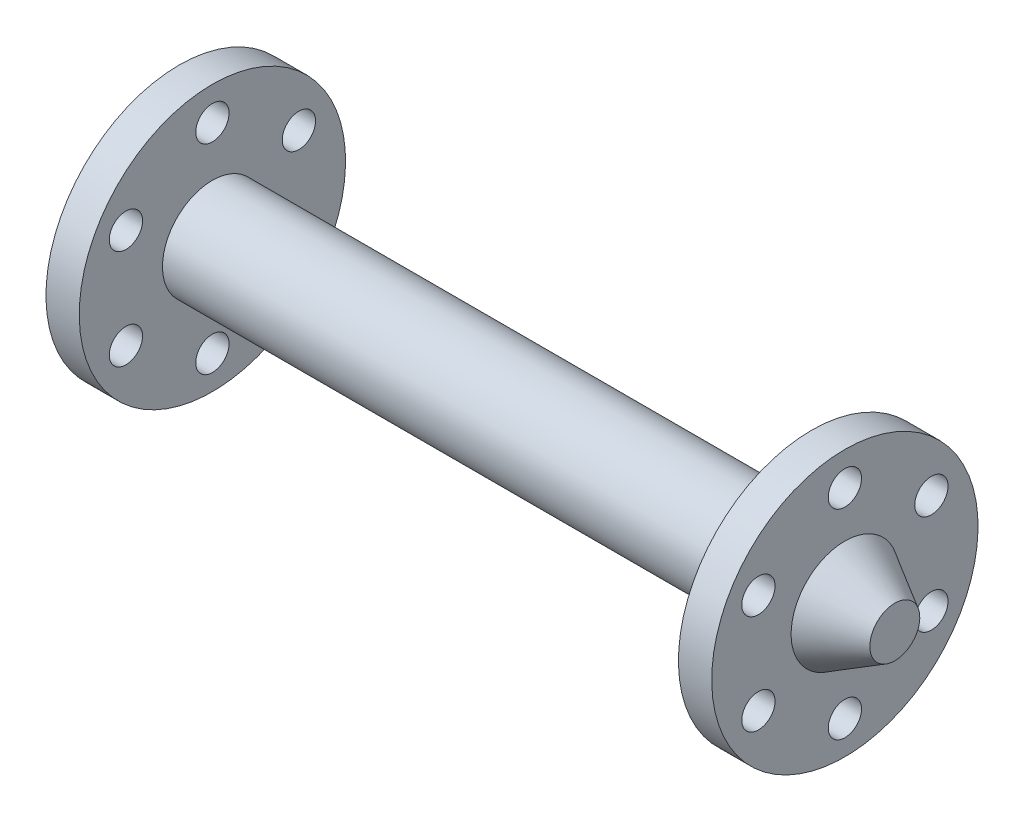
ISO-10303-21;
HEADER;
FILE_DESCRIPTION(('STEP AP214'),'2;1');
FILE_NAME('part.step','',(''),(''),'','','');
FILE_SCHEMA(('AUTOMOTIVE_DESIGN { 1 0 10303 214 1 1 1 1 }'));
ENDSEC;
DATA;
#1=APPLICATION_CONTEXT('core data for automotive mechanical design processes');
#2=APPLICATION_PROTOCOL_DEFINITION('international standard','automotive_design',2000,#1);
#3=PRODUCT_CONTEXT('',#1,'mechanical');
#4=PRODUCT('Part','Part','',(#3));
#5=PRODUCT_RELATED_PRODUCT_CATEGORY('part','',(#4));
#6=PRODUCT_DEFINITION_FORMATION('','',#4);
#7=PRODUCT_DEFINITION_CONTEXT('part definition',#1,'design');
#8=PRODUCT_DEFINITION('design','',#6,#7);
#9=PRODUCT_DEFINITION_SHAPE('','',#8);
#10=(LENGTH_UNIT() NAMED_UNIT(*) SI_UNIT(.MILLI.,.METRE.));
#11=(NAMED_UNIT(*) PLANE_ANGLE_UNIT() SI_UNIT($,.RADIAN.));
#12=(NAMED_UNIT(*) SI_UNIT($,.STERADIAN.) SOLID_ANGLE_UNIT());
#13=UNCERTAINTY_MEASURE_WITH_UNIT(LENGTH_MEASURE(1.E-05),#10,'distance_accuracy_value','');
#14=(GEOMETRIC_REPRESENTATION_CONTEXT(3) GLOBAL_UNCERTAINTY_ASSIGNED_CONTEXT((#13)) GLOBAL_UNIT_ASSIGNED_CONTEXT((#10,
#11,#12)) REPRESENTATION_CONTEXT('',''));
#15=CARTESIAN_POINT('',(0.,0.,0.));
#16=DIRECTION('',(0.,0.,1.));
#17=DIRECTION('',(1.,0.,0.));
#18=AXIS2_PLACEMENT_3D('',#15,#16,#17);
#19=CARTESIAN_POINT('',(-230.,0.,0.));
#20=DIRECTION('',(-1.,0.,0.));
#21=DIRECTION('',(0.,-1.,0.));
#22=AXIS2_PLACEMENT_3D('',#19,#20,#21);
#23=PLANE('',#22);
#24=CARTESIAN_POINT('',(-230.,0.,0.));
#25=DIRECTION('',(1.,0.,0.));
#26=DIRECTION('',(0.,1.,0.));
#27=AXIS2_PLACEMENT_3D('',#24,#25,#26);
#28=CIRCLE('',#27,15.);
#29=CARTESIAN_POINT('',(-230.,15.,0.));
#30=VERTEX_POINT('',#29);
#31=EDGE_CURVE('E10',#30,#30,#28,.T.);
#32=ORIENTED_EDGE('',*,*,#31,.F.);
#33=EDGE_LOOP('',(#32));
#34=FACE_BOUND('',#33,.T.);
#35=ADVANCED_FACE('F41',(#34),#23,.T.);
#36=CARTESIAN_POINT('',(-200.,0.,0.));
#37=DIRECTION('',(1.,0.,0.));
#38=DIRECTION('',(0.,1.,0.));
#39=AXIS2_PLACEMENT_3D('',#36,#37,#38);
#40=CONICAL_SURFACE('',#39,32.3205080756885,0.523598775598293);
#41=ORIENTED_EDGE('',*,*,#31,.T.);
#42=EDGE_LOOP('',(#41));
#43=FACE_BOUND('',#42,.T.);
#44=CARTESIAN_POINT('',(-200.,0.,0.));
#45=DIRECTION('',(1.,0.,0.));
#46=DIRECTION('',(0.,1.,0.));
#47=AXIS2_PLACEMENT_3D('',#44,#45,#46);
#48=CIRCLE('',#47,32.3205080756885);
#49=CARTESIAN_POINT('',(-200.,32.3205080756885,0.));
#50=VERTEX_POINT('',#49);
#51=EDGE_CURVE('E49',#50,#50,#48,.T.);
#52=ORIENTED_EDGE('',*,*,#51,.F.);
#53=EDGE_LOOP('',(#52));
#54=FACE_BOUND('',#53,.T.);
#55=ADVANCED_FACE('F184',(#43,#54),#40,.T.);
#56=CARTESIAN_POINT('',(-200.,32.3205080756885,0.));
#57=DIRECTION('',(-1.,0.,0.));
#58=DIRECTION('',(0.,-1.,0.));
#59=AXIS2_PLACEMENT_3D('',#56,#57,#58);
#60=PLANE('',#59);
#61=CARTESIAN_POINT('',(-200.,30.0000000000006,-51.961524227066));
#62=DIRECTION('',(-1.,0.,0.));
#63=DIRECTION('',(0.,0.,1.));
#64=AXIS2_PLACEMENT_3D('',#61,#62,#63);
#65=CIRCLE('',#64,9.99999999999995);
#66=CARTESIAN_POINT('',(-200.,30.0000000000006,-41.961524227066));
#67=VERTEX_POINT('',#66);
#68=EDGE_CURVE('E451',#67,#67,#65,.T.);
#69=ORIENTED_EDGE('',*,*,#68,.F.);
#70=EDGE_LOOP('',(#69));
#71=FACE_BOUND('',#70,.T.);
#72=CARTESIAN_POINT('',(-200.,-29.9999999999996,-51.9615242270666));
#73=DIRECTION('',(-1.,0.,0.));
#74=DIRECTION('',(0.,0.,1.));
#75=AXIS2_PLACEMENT_3D('',#72,#73,#74);
#76=CIRCLE('',#75,9.99999999999995);
#77=CARTESIAN_POINT('',(-200.,-29.9999999999996,-41.9615242270667));
#78=VERTEX_POINT('',#77);
#79=EDGE_CURVE('E62',#78,#78,#76,.T.);
#80=ORIENTED_EDGE('',*,*,#79,.F.);
#81=EDGE_LOOP('',(#80));
#82=FACE_BOUND('',#81,.T.);
#83=CARTESIAN_POINT('',(-200.,-60.0000000000001,0.));
#84=DIRECTION('',(-1.,0.,0.));
#85=DIRECTION('',(0.,0.,1.));
#86=AXIS2_PLACEMENT_3D('',#83,#84,#85);
#87=CIRCLE('',#86,9.99999999999995);
#88=CARTESIAN_POINT('',(-200.,-60.0000000000001,9.99999999999995));
#89=VERTEX_POINT('',#88);
#90=EDGE_CURVE('E84',#89,#89,#87,.T.);
#91=ORIENTED_EDGE('',*,*,#90,.F.);
#92=EDGE_LOOP('',(#91));
#93=FACE_BOUND('',#92,.T.);
#94=CARTESIAN_POINT('',(-200.,-30.0000000000003,51.9615242270662));
#95=DIRECTION('',(-1.,0.,0.));
#96=DIRECTION('',(0.,0.,1.));
#97=AXIS2_PLACEMENT_3D('',#94,#95,#96);
#98=CIRCLE('',#97,9.99999999999995);
#99=CARTESIAN_POINT('',(-200.,-30.0000000000003,61.9615242270662));
#100=VERTEX_POINT('',#99);
#101=EDGE_CURVE('E100',#100,#100,#98,.T.);
#102=ORIENTED_EDGE('',*,*,#101,.F.);
#103=EDGE_LOOP('',(#102));
#104=FACE_BOUND('',#103,.T.);
#105=CARTESIAN_POINT('',(-200.,29.9999999999999,51.9615242270664));
#106=DIRECTION('',(-1.,0.,0.));
#107=DIRECTION('',(0.,0.,1.));
#108=AXIS2_PLACEMENT_3D('',#105,#106,#107);
#109=CIRCLE('',#108,9.99999999999994);
#110=CARTESIAN_POINT('',(-200.,29.9999999999999,61.9615242270664));
#111=VERTEX_POINT('',#110);
#112=EDGE_CURVE('E116',#111,#111,#109,.T.);
#113=ORIENTED_EDGE('',*,*,#112,.F.);
#114=EDGE_LOOP('',(#113));
#115=FACE_BOUND('',#114,.T.);
#116=CARTESIAN_POINT('',(-200.,60.,0.));
#117=DIRECTION('',(-1.,0.,0.));
#118=DIRECTION('',(0.,0.,1.));
#119=AXIS2_PLACEMENT_3D('',#116,#117,#118);
#120=CIRCLE('',#119,9.99999999999995);
#121=CARTESIAN_POINT('',(-200.,60.,9.99999999999995));
#122=VERTEX_POINT('',#121);
#123=EDGE_CURVE('E132',#122,#122,#120,.T.);
#124=ORIENTED_EDGE('',*,*,#123,.F.);
#125=EDGE_LOOP('',(#124));
#126=FACE_BOUND('',#125,.T.);
#127=ORIENTED_EDGE('',*,*,#51,.T.);
#128=EDGE_LOOP('',(#127));
#129=FACE_BOUND('',#128,.T.);
#130=CARTESIAN_POINT('',(-200.,0.,0.));
#131=DIRECTION('',(1.,0.,0.));
#132=DIRECTION('',(0.,1.,0.));
#133=AXIS2_PLACEMENT_3D('',#130,#131,#132);
#134=CIRCLE('',#133,80.);
#135=CARTESIAN_POINT('',(-200.,80.,0.));
#136=VERTEX_POINT('',#135);
#137=EDGE_CURVE('E55',#136,#136,#134,.T.);
#138=ORIENTED_EDGE('',*,*,#137,.F.);
#139=EDGE_LOOP('',(#138));
#140=FACE_BOUND('',#139,.T.);
#141=ADVANCED_FACE('F182',(#71,#82,#93,#104,#115,#126,#129,#140),#60,.T.);
#142=CARTESIAN_POINT('',(230.,0.,0.));
#143=DIRECTION('',(1.,0.,0.));
#144=DIRECTION('',(0.,1.,0.));
#145=AXIS2_PLACEMENT_3D('',#142,#143,#144);
#146=CYLINDRICAL_SURFACE('',#145,80.);
#147=ORIENTED_EDGE('',*,*,#137,.T.);
#148=EDGE_LOOP('',(#147));
#149=FACE_BOUND('',#148,.T.);
#150=CARTESIAN_POINT('',(-180.,0.,0.));
#151=DIRECTION('',(1.,0.,0.));
#152=DIRECTION('',(0.,1.,0.));
#153=AXIS2_PLACEMENT_3D('',#150,#151,#152);
#154=CIRCLE('',#153,80.);
#155=CARTESIAN_POINT('',(-180.,80.,0.));
#156=VERTEX_POINT('',#155);
#157=EDGE_CURVE('E172',#156,#156,#154,.T.);
#158=ORIENTED_EDGE('',*,*,#157,.F.);
#159=EDGE_LOOP('',(#158));
#160=FACE_BOUND('',#159,.T.);
#161=ADVANCED_FACE('F179',(#149,#160),#146,.T.);
#162=CARTESIAN_POINT('',(-180.,80.,0.));
#163=DIRECTION('',(1.,0.,0.));
#164=DIRECTION('',(0.,1.,0.));
#165=AXIS2_PLACEMENT_3D('',#162,#163,#164);
#166=PLANE('',#165);
#167=CARTESIAN_POINT('',(-180.,30.0000000000006,-51.961524227066));
#168=DIRECTION('',(1.,0.,0.));
#169=DIRECTION('',(0.,1.,0.));
#170=AXIS2_PLACEMENT_3D('',#167,#168,#169);
#171=CIRCLE('',#170,9.99999999999992);
#172=CARTESIAN_POINT('',(-180.,40.0000000000005,-51.961524227066));
#173=VERTEX_POINT('',#172);
#174=EDGE_CURVE('E71',#173,#173,#171,.T.);
#175=ORIENTED_EDGE('',*,*,#174,.F.);
#176=EDGE_LOOP('',(#175));
#177=FACE_BOUND('',#176,.T.);
#178=CARTESIAN_POINT('',(-180.,-29.9999999999996,-51.9615242270666));
#179=DIRECTION('',(1.,0.,0.));
#180=DIRECTION('',(0.,1.,0.));
#181=AXIS2_PLACEMENT_3D('',#178,#179,#180);
#182=CIRCLE('',#181,9.99999999999992);
#183=CARTESIAN_POINT('',(-180.,-19.9999999999996,-51.9615242270666));
#184=VERTEX_POINT('',#183);
#185=EDGE_CURVE('E68',#184,#184,#182,.T.);
#186=ORIENTED_EDGE('',*,*,#185,.F.);
#187=EDGE_LOOP('',(#186));
#188=FACE_BOUND('',#187,.T.);
#189=CARTESIAN_POINT('',(-180.,-60.0000000000001,0.));
#190=DIRECTION('',(1.,0.,0.));
#191=DIRECTION('',(0.,1.,0.));
#192=AXIS2_PLACEMENT_3D('',#189,#190,#191);
#193=CIRCLE('',#192,9.99999999999992);
#194=CARTESIAN_POINT('',(-180.,-50.0000000000001,0.));
#195=VERTEX_POINT('',#194);
#196=EDGE_CURVE('E96',#195,#195,#193,.T.);
#197=ORIENTED_EDGE('',*,*,#196,.F.);
#198=EDGE_LOOP('',(#197));
#199=FACE_BOUND('',#198,.T.);
#200=CARTESIAN_POINT('',(-180.,-30.0000000000003,51.9615242270662));
#201=DIRECTION('',(1.,0.,0.));
#202=DIRECTION('',(0.,1.,0.));
#203=AXIS2_PLACEMENT_3D('',#200,#201,#202);
#204=CIRCLE('',#203,9.99999999999992);
#205=CARTESIAN_POINT('',(-180.,-20.0000000000004,51.9615242270662));
#206=VERTEX_POINT('',#205);
#207=EDGE_CURVE('E112',#206,#206,#204,.T.);
#208=ORIENTED_EDGE('',*,*,#207,.F.);
#209=EDGE_LOOP('',(#208));
#210=FACE_BOUND('',#209,.T.);
#211=CARTESIAN_POINT('',(-180.,29.9999999999999,51.9615242270664));
#212=DIRECTION('',(1.,0.,0.));
#213=DIRECTION('',(0.,1.,0.));
#214=AXIS2_PLACEMENT_3D('',#211,#212,#213);
#215=CIRCLE('',#214,9.99999999999992);
#216=CARTESIAN_POINT('',(-180.,39.9999999999998,51.9615242270664));
#217=VERTEX_POINT('',#216);
#218=EDGE_CURVE('E128',#217,#217,#215,.T.);
#219=ORIENTED_EDGE('',*,*,#218,.F.);
#220=EDGE_LOOP('',(#219));
#221=FACE_BOUND('',#220,.T.);
#222=CARTESIAN_POINT('',(-180.,60.,0.));
#223=DIRECTION('',(1.,0.,0.));
#224=DIRECTION('',(0.,1.,0.));
#225=AXIS2_PLACEMENT_3D('',#222,#223,#224);
#226=CIRCLE('',#225,9.99999999999992);
#227=CARTESIAN_POINT('',(-180.,69.9999999999999,0.));
#228=VERTEX_POINT('',#227);
#229=EDGE_CURVE('E136',#228,#228,#226,.T.);
#230=ORIENTED_EDGE('',*,*,#229,.F.);
#231=EDGE_LOOP('',(#230));
#232=FACE_BOUND('',#231,.T.);
#233=ORIENTED_EDGE('',*,*,#157,.T.);
#234=EDGE_LOOP('',(#233));
#235=FACE_BOUND('',#234,.T.);
#236=CARTESIAN_POINT('',(-180.,0.,0.));
#237=DIRECTION('',(1.,0.,0.));
#238=DIRECTION('',(0.,1.,0.));
#239=AXIS2_PLACEMENT_3D('',#236,#237,#238);
#240=CIRCLE('',#239,30.);
#241=CARTESIAN_POINT('',(-180.,30.,0.));
#242=VERTEX_POINT('',#241);
#243=EDGE_CURVE('E168',#242,#242,#240,.T.);
#244=ORIENTED_EDGE('',*,*,#243,.F.);
#245=EDGE_LOOP('',(#244));
#246=FACE_BOUND('',#245,.T.);
#247=ADVANCED_FACE('F191',(#177,#188,#199,#210,#221,#232,#235,#246),#166,.T.);
#248=CARTESIAN_POINT('',(230.,0.,0.));
#249=DIRECTION('',(1.,0.,0.));
#250=DIRECTION('',(0.,1.,0.));
#251=AXIS2_PLACEMENT_3D('',#248,#249,#250);
#252=CYLINDRICAL_SURFACE('',#251,30.);
#253=ORIENTED_EDGE('',*,*,#243,.T.);
#254=EDGE_LOOP('',(#253));
#255=FACE_BOUND('',#254,.T.);
#256=CARTESIAN_POINT('',(180.,0.,0.));
#257=DIRECTION('',(1.,0.,0.));
#258=DIRECTION('',(0.,1.,0.));
#259=AXIS2_PLACEMENT_3D('',#256,#257,#258);
#260=CIRCLE('',#259,30.);
#261=CARTESIAN_POINT('',(180.,30.,0.));
#262=VERTEX_POINT('',#261);
#263=EDGE_CURVE('E164',#262,#262,#260,.T.);
#264=ORIENTED_EDGE('',*,*,#263,.F.);
#265=EDGE_LOOP('',(#264));
#266=FACE_BOUND('',#265,.T.);
#267=ADVANCED_FACE('F219',(#255,#266),#252,.T.);
#268=CARTESIAN_POINT('',(180.,30.,0.));
#269=DIRECTION('',(-1.,0.,0.));
#270=DIRECTION('',(0.,-1.,0.));
#271=AXIS2_PLACEMENT_3D('',#268,#269,#270);
#272=PLANE('',#271);
#273=CARTESIAN_POINT('',(180.,30.0000000000006,-51.961524227066));
#274=DIRECTION('',(-1.,0.,0.));
#275=DIRECTION('',(0.,-1.,0.));
#276=AXIS2_PLACEMENT_3D('',#273,#274,#275);
#277=CIRCLE('',#276,9.99999999999992);
#278=CARTESIAN_POINT('',(180.,20.0000000000007,-51.961524227066));
#279=VERTEX_POINT('',#278);
#280=EDGE_CURVE('E77',#279,#279,#277,.T.);
#281=ORIENTED_EDGE('',*,*,#280,.F.);
#282=EDGE_LOOP('',(#281));
#283=FACE_BOUND('',#282,.T.);
#284=CARTESIAN_POINT('',(180.,-29.9999999999996,-51.9615242270666));
#285=DIRECTION('',(-1.,0.,0.));
#286=DIRECTION('',(0.,-1.,0.));
#287=AXIS2_PLACEMENT_3D('',#284,#285,#286);
#288=CIRCLE('',#287,9.99999999999992);
#289=CARTESIAN_POINT('',(180.,-39.9999999999995,-51.9615242270666));
#290=VERTEX_POINT('',#289);
#291=EDGE_CURVE('E61',#290,#290,#288,.T.);
#292=ORIENTED_EDGE('',*,*,#291,.F.);
#293=EDGE_LOOP('',(#292));
#294=FACE_BOUND('',#293,.T.);
#295=CARTESIAN_POINT('',(180.,-60.0000000000001,0.));
#296=DIRECTION('',(-1.,0.,0.));
#297=DIRECTION('',(0.,-1.,0.));
#298=AXIS2_PLACEMENT_3D('',#295,#296,#297);
#299=CIRCLE('',#298,9.99999999999992);
#300=CARTESIAN_POINT('',(180.,-70.,0.));
#301=VERTEX_POINT('',#300);
#302=EDGE_CURVE('E92',#301,#301,#299,.T.);
#303=ORIENTED_EDGE('',*,*,#302,.F.);
#304=EDGE_LOOP('',(#303));
#305=FACE_BOUND('',#304,.T.);
#306=CARTESIAN_POINT('',(180.,-30.0000000000003,51.9615242270662));
#307=DIRECTION('',(-1.,0.,0.));
#308=DIRECTION('',(0.,-1.,0.));
#309=AXIS2_PLACEMENT_3D('',#306,#307,#308);
#310=CIRCLE('',#309,9.99999999999992);
#311=CARTESIAN_POINT('',(180.,-40.0000000000002,51.9615242270662));
#312=VERTEX_POINT('',#311);
#313=EDGE_CURVE('E104',#312,#312,#310,.T.);
#314=ORIENTED_EDGE('',*,*,#313,.F.);
#315=EDGE_LOOP('',(#314));
#316=FACE_BOUND('',#315,.T.);
#317=CARTESIAN_POINT('',(180.,29.9999999999999,51.9615242270664));
#318=DIRECTION('',(-1.,0.,0.));
#319=DIRECTION('',(0.,-1.,0.));
#320=AXIS2_PLACEMENT_3D('',#317,#318,#319);
#321=CIRCLE('',#320,9.99999999999992);
#322=CARTESIAN_POINT('',(180.,20.,51.9615242270664));
#323=VERTEX_POINT('',#322);
#324=EDGE_CURVE('E124',#323,#323,#321,.T.);
#325=ORIENTED_EDGE('',*,*,#324,.F.);
#326=EDGE_LOOP('',(#325));
#327=FACE_BOUND('',#326,.T.);
#328=CARTESIAN_POINT('',(180.,60.,0.));
#329=DIRECTION('',(-1.,0.,0.));
#330=DIRECTION('',(0.,-1.,0.));
#331=AXIS2_PLACEMENT_3D('',#328,#329,#330);
#332=CIRCLE('',#331,9.99999999999992);
#333=CARTESIAN_POINT('',(180.,50.0000000000001,0.));
#334=VERTEX_POINT('',#333);
#335=EDGE_CURVE('E144',#334,#334,#332,.T.);
#336=ORIENTED_EDGE('',*,*,#335,.F.);
#337=EDGE_LOOP('',(#336));
#338=FACE_BOUND('',#337,.T.);
#339=ORIENTED_EDGE('',*,*,#263,.T.);
#340=EDGE_LOOP('',(#339));
#341=FACE_BOUND('',#340,.T.);
#342=CARTESIAN_POINT('',(180.,0.,0.));
#343=DIRECTION('',(1.,0.,0.));
#344=DIRECTION('',(0.,1.,0.));
#345=AXIS2_PLACEMENT_3D('',#342,#343,#344);
#346=CIRCLE('',#345,79.9999999999999);
#347=CARTESIAN_POINT('',(180.,80.,0.));
#348=VERTEX_POINT('',#347);
#349=EDGE_CURVE('E160',#348,#348,#346,.T.);
#350=ORIENTED_EDGE('',*,*,#349,.F.);
#351=EDGE_LOOP('',(#350));
#352=FACE_BOUND('',#351,.T.);
#353=ADVANCED_FACE('F224',(#283,#294,#305,#316,#327,#338,#341,#352),#272,.T.);
#354=CARTESIAN_POINT('',(230.,0.,0.));
#355=DIRECTION('',(1.,0.,0.));
#356=DIRECTION('',(0.,1.,0.));
#357=AXIS2_PLACEMENT_3D('',#354,#355,#356);
#358=CYLINDRICAL_SURFACE('',#357,79.9999999999999);
#359=ORIENTED_EDGE('',*,*,#349,.T.);
#360=EDGE_LOOP('',(#359));
#361=FACE_BOUND('',#360,.T.);
#362=CARTESIAN_POINT('',(200.,0.,0.));
#363=DIRECTION('',(1.,0.,0.));
#364=DIRECTION('',(0.,1.,0.));
#365=AXIS2_PLACEMENT_3D('',#362,#363,#364);
#366=CIRCLE('',#365,80.);
#367=CARTESIAN_POINT('',(200.,80.,0.));
#368=VERTEX_POINT('',#367);
#369=EDGE_CURVE('E156',#368,#368,#366,.T.);
#370=ORIENTED_EDGE('',*,*,#369,.F.);
#371=EDGE_LOOP('',(#370));
#372=FACE_BOUND('',#371,.T.);
#373=ADVANCED_FACE('F233',(#361,#372),#358,.T.);
#374=CARTESIAN_POINT('',(200.,80.,0.));
#375=DIRECTION('',(1.,0.,0.));
#376=DIRECTION('',(0.,1.,0.));
#377=AXIS2_PLACEMENT_3D('',#374,#375,#376);
#378=PLANE('',#377);
#379=CARTESIAN_POINT('',(200.,30.0000000000006,-51.961524227066));
#380=DIRECTION('',(1.,0.,0.));
#381=DIRECTION('',(0.,1.,0.));
#382=AXIS2_PLACEMENT_3D('',#379,#380,#381);
#383=CIRCLE('',#382,9.99999999999992);
#384=CARTESIAN_POINT('',(200.,40.0000000000005,-51.961524227066));
#385=VERTEX_POINT('',#384);
#386=EDGE_CURVE('E44',#385,#385,#383,.T.);
#387=ORIENTED_EDGE('',*,*,#386,.F.);
#388=EDGE_LOOP('',(#387));
#389=FACE_BOUND('',#388,.T.);
#390=CARTESIAN_POINT('',(200.,-29.9999999999996,-51.9615242270666));
#391=DIRECTION('',(1.,0.,0.));
#392=DIRECTION('',(0.,1.,0.));
#393=AXIS2_PLACEMENT_3D('',#390,#391,#392);
#394=CIRCLE('',#393,9.99999999999992);
#395=CARTESIAN_POINT('',(200.,-19.9999999999996,-51.9615242270666));
#396=VERTEX_POINT('',#395);
#397=EDGE_CURVE('E58',#396,#396,#394,.T.);
#398=ORIENTED_EDGE('',*,*,#397,.F.);
#399=EDGE_LOOP('',(#398));
#400=FACE_BOUND('',#399,.T.);
#401=CARTESIAN_POINT('',(200.,-60.0000000000001,0.));
#402=DIRECTION('',(1.,0.,0.));
#403=DIRECTION('',(0.,1.,0.));
#404=AXIS2_PLACEMENT_3D('',#401,#402,#403);
#405=CIRCLE('',#404,9.99999999999992);
#406=CARTESIAN_POINT('',(200.,-50.0000000000001,0.));
#407=VERTEX_POINT('',#406);
#408=EDGE_CURVE('E88',#407,#407,#405,.T.);
#409=ORIENTED_EDGE('',*,*,#408,.F.);
#410=EDGE_LOOP('',(#409));
#411=FACE_BOUND('',#410,.T.);
#412=CARTESIAN_POINT('',(200.,-30.0000000000003,51.9615242270662));
#413=DIRECTION('',(1.,0.,0.));
#414=DIRECTION('',(0.,1.,0.));
#415=AXIS2_PLACEMENT_3D('',#412,#413,#414);
#416=CIRCLE('',#415,9.99999999999992);
#417=CARTESIAN_POINT('',(200.,-20.0000000000004,51.9615242270662));
#418=VERTEX_POINT('',#417);
#419=EDGE_CURVE('E108',#418,#418,#416,.T.);
#420=ORIENTED_EDGE('',*,*,#419,.F.);
#421=EDGE_LOOP('',(#420));
#422=FACE_BOUND('',#421,.T.);
#423=CARTESIAN_POINT('',(200.,29.9999999999999,51.9615242270664));
#424=DIRECTION('',(1.,0.,0.));
#425=DIRECTION('',(0.,1.,0.));
#426=AXIS2_PLACEMENT_3D('',#423,#424,#425);
#427=CIRCLE('',#426,9.99999999999992);
#428=CARTESIAN_POINT('',(200.,39.9999999999998,51.9615242270664));
#429=VERTEX_POINT('',#428);
#430=EDGE_CURVE('E120',#429,#429,#427,.T.);
#431=ORIENTED_EDGE('',*,*,#430,.F.);
#432=EDGE_LOOP('',(#431));
#433=FACE_BOUND('',#432,.T.);
#434=CARTESIAN_POINT('',(200.,60.,0.));
#435=DIRECTION('',(1.,0.,0.));
#436=DIRECTION('',(0.,1.,0.));
#437=AXIS2_PLACEMENT_3D('',#434,#435,#436);
#438=CIRCLE('',#437,9.99999999999992);
#439=CARTESIAN_POINT('',(200.,69.9999999999999,0.));
#440=VERTEX_POINT('',#439);
#441=EDGE_CURVE('E140',#440,#440,#438,.T.);
#442=ORIENTED_EDGE('',*,*,#441,.F.);
#443=EDGE_LOOP('',(#442));
#444=FACE_BOUND('',#443,.T.);
#445=ORIENTED_EDGE('',*,*,#369,.T.);
#446=EDGE_LOOP('',(#445));
#447=FACE_BOUND('',#446,.T.);
#448=CARTESIAN_POINT('',(200.,0.,0.));
#449=DIRECTION('',(1.,0.,0.));
#450=DIRECTION('',(0.,1.,0.));
#451=AXIS2_PLACEMENT_3D('',#448,#449,#450);
#452=CIRCLE('',#451,32.3205080756885);
#453=CARTESIAN_POINT('',(200.,32.3205080756886,0.));
#454=VERTEX_POINT('',#453);
#455=EDGE_CURVE('E152',#454,#454,#452,.T.);
#456=ORIENTED_EDGE('',*,*,#455,.F.);
#457=EDGE_LOOP('',(#456));
#458=FACE_BOUND('',#457,.T.);
#459=ADVANCED_FACE('F238',(#389,#400,#411,#422,#433,#444,#447,#458),#378,.T.);
#460=CARTESIAN_POINT('',(230.,0.,0.));
#461=DIRECTION('',(-1.,0.,0.));
#462=DIRECTION('',(0.,-1.,0.));
#463=AXIS2_PLACEMENT_3D('',#460,#461,#462);
#464=CONICAL_SURFACE('',#463,15.,0.523598775598293);
#465=ORIENTED_EDGE('',*,*,#455,.T.);
#466=EDGE_LOOP('',(#465));
#467=FACE_BOUND('',#466,.T.);
#468=CARTESIAN_POINT('',(230.,0.,0.));
#469=DIRECTION('',(1.,0.,0.));
#470=DIRECTION('',(0.,1.,0.));
#471=AXIS2_PLACEMENT_3D('',#468,#469,#470);
#472=CIRCLE('',#471,15.);
#473=CARTESIAN_POINT('',(230.,15.0000000000001,0.));
#474=VERTEX_POINT('',#473);
#475=EDGE_CURVE('E148',#474,#474,#472,.T.);
#476=ORIENTED_EDGE('',*,*,#475,.F.);
#477=EDGE_LOOP('',(#476));
#478=FACE_BOUND('',#477,.T.);
#479=ADVANCED_FACE('F247',(#467,#478),#464,.T.);
#480=CARTESIAN_POINT('',(230.,15.0000000000001,0.));
#481=DIRECTION('',(1.,0.,0.));
#482=DIRECTION('',(0.,1.,0.));
#483=AXIS2_PLACEMENT_3D('',#480,#481,#482);
#484=PLANE('',#483);
#485=ORIENTED_EDGE('',*,*,#475,.T.);
#486=EDGE_LOOP('',(#485));
#487=FACE_BOUND('',#486,.T.);
#488=ADVANCED_FACE('F252',(#487),#484,.T.);
#489=CARTESIAN_POINT('',(-200.,60.,0.));
#490=DIRECTION('',(-1.,0.,0.));
#491=DIRECTION('',(0.,0.,1.));
#492=AXIS2_PLACEMENT_3D('',#489,#490,#491);
#493=CYLINDRICAL_SURFACE('',#492,9.99999999999992);
#494=ORIENTED_EDGE('',*,*,#229,.T.);
#495=EDGE_LOOP('',(#494));
#496=FACE_BOUND('',#495,.T.);
#497=ORIENTED_EDGE('',*,*,#123,.T.);
#498=EDGE_LOOP('',(#497));
#499=FACE_BOUND('',#498,.T.);
#500=ADVANCED_FACE('F263',(#496,#499),#493,.F.);
#501=ORIENTED_EDGE('',*,*,#335,.T.);
#502=EDGE_LOOP('',(#501));
#503=FACE_BOUND('',#502,.T.);
#504=ORIENTED_EDGE('',*,*,#441,.T.);
#505=EDGE_LOOP('',(#504));
#506=FACE_BOUND('',#505,.T.);
#507=ADVANCED_FACE('F274',(#503,#506),#493,.F.);
#508=CARTESIAN_POINT('',(-200.,29.9999999999999,51.9615242270664));
#509=DIRECTION('',(-1.,0.,0.));
#510=DIRECTION('',(0.,0.,1.));
#511=AXIS2_PLACEMENT_3D('',#508,#509,#510);
#512=CYLINDRICAL_SURFACE('',#511,9.99999999999992);
#513=ORIENTED_EDGE('',*,*,#218,.T.);
#514=EDGE_LOOP('',(#513));
#515=FACE_BOUND('',#514,.T.);
#516=ORIENTED_EDGE('',*,*,#112,.T.);
#517=EDGE_LOOP('',(#516));
#518=FACE_BOUND('',#517,.T.);
#519=ADVANCED_FACE('F284',(#515,#518),#512,.F.);
#520=ORIENTED_EDGE('',*,*,#324,.T.);
#521=EDGE_LOOP('',(#520));
#522=FACE_BOUND('',#521,.T.);
#523=ORIENTED_EDGE('',*,*,#430,.T.);
#524=EDGE_LOOP('',(#523));
#525=FACE_BOUND('',#524,.T.);
#526=ADVANCED_FACE('F323',(#522,#525),#512,.F.);
#527=CARTESIAN_POINT('',(-200.,-30.0000000000003,51.9615242270662));
#528=DIRECTION('',(-1.,0.,0.));
#529=DIRECTION('',(0.,0.,1.));
#530=AXIS2_PLACEMENT_3D('',#527,#528,#529);
#531=CYLINDRICAL_SURFACE('',#530,9.99999999999992);
#532=ORIENTED_EDGE('',*,*,#207,.T.);
#533=EDGE_LOOP('',(#532));
#534=FACE_BOUND('',#533,.T.);
#535=ORIENTED_EDGE('',*,*,#101,.T.);
#536=EDGE_LOOP('',(#535));
#537=FACE_BOUND('',#536,.T.);
#538=ADVANCED_FACE('F334',(#534,#537),#531,.F.);
#539=ORIENTED_EDGE('',*,*,#419,.T.);
#540=EDGE_LOOP('',(#539));
#541=FACE_BOUND('',#540,.T.);
#542=ORIENTED_EDGE('',*,*,#313,.T.);
#543=EDGE_LOOP('',(#542));
#544=FACE_BOUND('',#543,.T.);
#545=ADVANCED_FACE('F344',(#541,#544),#531,.F.);
#546=CARTESIAN_POINT('',(-200.,-60.0000000000001,0.));
#547=DIRECTION('',(-1.,0.,0.));
#548=DIRECTION('',(0.,0.,1.));
#549=AXIS2_PLACEMENT_3D('',#546,#547,#548);
#550=CYLINDRICAL_SURFACE('',#549,9.99999999999992);
#551=ORIENTED_EDGE('',*,*,#196,.T.);
#552=EDGE_LOOP('',(#551));
#553=FACE_BOUND('',#552,.T.);
#554=ORIENTED_EDGE('',*,*,#90,.T.);
#555=EDGE_LOOP('',(#554));
#556=FACE_BOUND('',#555,.T.);
#557=ADVANCED_FACE('F355',(#553,#556),#550,.F.);
#558=ORIENTED_EDGE('',*,*,#302,.T.);
#559=EDGE_LOOP('',(#558));
#560=FACE_BOUND('',#559,.T.);
#561=ORIENTED_EDGE('',*,*,#408,.T.);
#562=EDGE_LOOP('',(#561));
#563=FACE_BOUND('',#562,.T.);
#564=ADVANCED_FACE('F365',(#560,#563),#550,.F.);
#565=CARTESIAN_POINT('',(-200.,-29.9999999999996,-51.9615242270666));
#566=DIRECTION('',(-1.,0.,0.));
#567=DIRECTION('',(0.,0.,1.));
#568=AXIS2_PLACEMENT_3D('',#565,#566,#567);
#569=CYLINDRICAL_SURFACE('',#568,9.99999999999992);
#570=ORIENTED_EDGE('',*,*,#291,.T.);
#571=EDGE_LOOP('',(#570));
#572=FACE_BOUND('',#571,.T.);
#573=ORIENTED_EDGE('',*,*,#397,.T.);
#574=EDGE_LOOP('',(#573));
#575=FACE_BOUND('',#574,.T.);
#576=ADVANCED_FACE('F376',(#572,#575),#569,.F.);
#577=ORIENTED_EDGE('',*,*,#185,.T.);
#578=EDGE_LOOP('',(#577));
#579=FACE_BOUND('',#578,.T.);
#580=ORIENTED_EDGE('',*,*,#79,.T.);
#581=EDGE_LOOP('',(#580));
#582=FACE_BOUND('',#581,.T.);
#583=ADVANCED_FACE('F386',(#579,#582),#569,.F.);
#584=CARTESIAN_POINT('',(-200.,30.0000000000006,-51.961524227066));
#585=DIRECTION('',(-1.,0.,0.));
#586=DIRECTION('',(0.,0.,1.));
#587=AXIS2_PLACEMENT_3D('',#584,#585,#586);
#588=CYLINDRICAL_SURFACE('',#587,9.99999999999992);
#589=ORIENTED_EDGE('',*,*,#280,.T.);
#590=EDGE_LOOP('',(#589));
#591=FACE_BOUND('',#590,.T.);
#592=ORIENTED_EDGE('',*,*,#386,.T.);
#593=EDGE_LOOP('',(#592));
#594=FACE_BOUND('',#593,.T.);
#595=ADVANCED_FACE('F397',(#591,#594),#588,.F.);
#596=ORIENTED_EDGE('',*,*,#174,.T.);
#597=EDGE_LOOP('',(#596));
#598=FACE_BOUND('',#597,.T.);
#599=ORIENTED_EDGE('',*,*,#68,.T.);
#600=EDGE_LOOP('',(#599));
#601=FACE_BOUND('',#600,.T.);
#602=ADVANCED_FACE('F407',(#598,#601),#588,.F.);
#603=CLOSED_SHELL('',(#35,#55,#141,#161,#247,#267,#353,#373,#459,#479,#488,#500,#507,#519,#526,
#538,#545,#557,#564,#576,#583,#595,#602));
#604=MANIFOLD_SOLID_BREP('B2',#603);
#605=ADVANCED_BREP_SHAPE_REPRESENTATION('',(#18,#604),#14);
#606=SHAPE_DEFINITION_REPRESENTATION(#9,#605);
ENDSEC;
END-ISO-10303-21;
